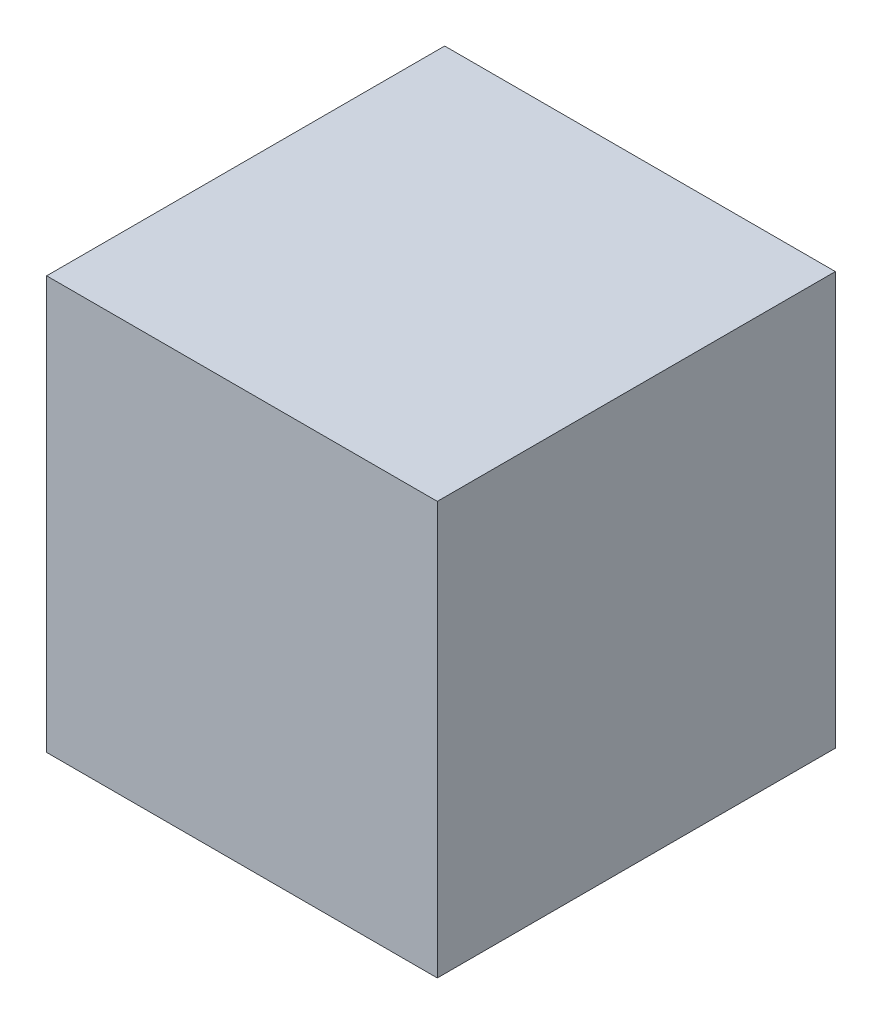
ISO-10303-21;
HEADER;
FILE_DESCRIPTION(('STEP AP214'),'2;1');
FILE_NAME('part.step','',(''),(''),'','','');
FILE_SCHEMA(('AUTOMOTIVE_DESIGN { 1 0 10303 214 1 1 1 1 }'));
ENDSEC;
DATA;
#1=APPLICATION_CONTEXT('core data for automotive mechanical design processes');
#2=APPLICATION_PROTOCOL_DEFINITION('international standard','automotive_design',2000,#1);
#3=PRODUCT_CONTEXT('',#1,'mechanical');
#4=PRODUCT('Part','Part','',(#3));
#5=PRODUCT_RELATED_PRODUCT_CATEGORY('part','',(#4));
#6=PRODUCT_DEFINITION_FORMATION('','',#4);
#7=PRODUCT_DEFINITION_CONTEXT('part definition',#1,'design');
#8=PRODUCT_DEFINITION('design','',#6,#7);
#9=PRODUCT_DEFINITION_SHAPE('','',#8);
#10=(LENGTH_UNIT() NAMED_UNIT(*) SI_UNIT(.MILLI.,.METRE.));
#11=(NAMED_UNIT(*) PLANE_ANGLE_UNIT() SI_UNIT($,.RADIAN.));
#12=(NAMED_UNIT(*) SI_UNIT($,.STERADIAN.) SOLID_ANGLE_UNIT());
#13=UNCERTAINTY_MEASURE_WITH_UNIT(LENGTH_MEASURE(1.E-05),#10,'distance_accuracy_value','');
#14=(GEOMETRIC_REPRESENTATION_CONTEXT(3) GLOBAL_UNCERTAINTY_ASSIGNED_CONTEXT((#13)) GLOBAL_UNIT_ASSIGNED_CONTEXT((#10,
#11,#12)) REPRESENTATION_CONTEXT('',''));
#15=CARTESIAN_POINT('',(0.,0.,0.));
#16=DIRECTION('',(0.,0.,1.));
#17=DIRECTION('',(1.,0.,0.));
#18=AXIS2_PLACEMENT_3D('',#15,#16,#17);
#19=CARTESIAN_POINT('',(0.,0.,171.45));
#20=DIRECTION('',(1.,0.,0.));
#21=DIRECTION('',(0.,0.,-1.));
#22=AXIS2_PLACEMENT_3D('',#19,#20,#21);
#23=PLANE('',#22);
#24=DIRECTION('',(0.,-1.,0.));
#25=VECTOR('',#24,1.);
#26=CARTESIAN_POINT('',(0.,0.,0.));
#27=LINE('',#26,#25);
#28=CARTESIAN_POINT('',(0.,177.8,0.));
#29=VERTEX_POINT('',#28);
#30=CARTESIAN_POINT('',(0.,0.,0.));
#31=VERTEX_POINT('',#30);
#32=EDGE_CURVE('E95',#29,#31,#27,.T.);
#33=ORIENTED_EDGE('',*,*,#32,.T.);
#34=DIRECTION('',(0.,0.,-1.));
#35=VECTOR('',#34,1.);
#36=CARTESIAN_POINT('',(0.,0.,171.45));
#37=LINE('',#36,#35);
#38=CARTESIAN_POINT('',(0.,0.,171.45));
#39=VERTEX_POINT('',#38);
#40=EDGE_CURVE('E11',#39,#31,#37,.T.);
#41=ORIENTED_EDGE('',*,*,#40,.F.);
#42=DIRECTION('',(0.,-1.,0.));
#43=VECTOR('',#42,1.);
#44=CARTESIAN_POINT('',(0.,0.,171.45));
#45=LINE('',#44,#43);
#46=CARTESIAN_POINT('',(0.,177.8,171.45));
#47=VERTEX_POINT('',#46);
#48=EDGE_CURVE('E83',#47,#39,#45,.T.);
#49=ORIENTED_EDGE('',*,*,#48,.F.);
#50=DIRECTION('',(0.,0.,-1.));
#51=VECTOR('',#50,1.);
#52=CARTESIAN_POINT('',(0.,177.8,171.45));
#53=LINE('',#52,#51);
#54=EDGE_CURVE('E91',#47,#29,#53,.T.);
#55=ORIENTED_EDGE('',*,*,#54,.T.);
#56=EDGE_LOOP('',(#33,#41,#49,#55));
#57=FACE_BOUND('',#56,.T.);
#58=ADVANCED_FACE('F32',(#57),#23,.F.);
#59=CARTESIAN_POINT('',(0.,0.,171.45));
#60=DIRECTION('',(0.,1.,0.));
#61=DIRECTION('',(0.,0.,1.));
#62=AXIS2_PLACEMENT_3D('',#59,#60,#61);
#63=PLANE('',#62);
#64=DIRECTION('',(1.,0.,0.));
#65=VECTOR('',#64,1.);
#66=CARTESIAN_POINT('',(0.,0.,0.));
#67=LINE('',#66,#65);
#68=CARTESIAN_POINT('',(168.275,0.,0.));
#69=VERTEX_POINT('',#68);
#70=EDGE_CURVE('E87',#31,#69,#67,.T.);
#71=ORIENTED_EDGE('',*,*,#70,.T.);
#72=DIRECTION('',(0.,0.,-1.));
#73=VECTOR('',#72,1.);
#74=CARTESIAN_POINT('',(168.275,0.,171.45));
#75=LINE('',#74,#73);
#76=CARTESIAN_POINT('',(168.275,0.,171.45));
#77=VERTEX_POINT('',#76);
#78=EDGE_CURVE('E40',#77,#69,#75,.T.);
#79=ORIENTED_EDGE('',*,*,#78,.F.);
#80=DIRECTION('',(1.,0.,0.));
#81=VECTOR('',#80,1.);
#82=CARTESIAN_POINT('',(0.,0.,171.45));
#83=LINE('',#82,#81);
#84=EDGE_CURVE('E78',#39,#77,#83,.T.);
#85=ORIENTED_EDGE('',*,*,#84,.F.);
#86=ORIENTED_EDGE('',*,*,#40,.T.);
#87=EDGE_LOOP('',(#71,#79,#85,#86));
#88=FACE_BOUND('',#87,.T.);
#89=ADVANCED_FACE('F86',(#88),#63,.F.);
#90=CARTESIAN_POINT('',(168.275,0.,171.45));
#91=DIRECTION('',(-1.,0.,0.));
#92=DIRECTION('',(0.,0.,1.));
#93=AXIS2_PLACEMENT_3D('',#90,#91,#92);
#94=PLANE('',#93);
#95=DIRECTION('',(0.,1.,0.));
#96=VECTOR('',#95,1.);
#97=CARTESIAN_POINT('',(168.275,0.,0.));
#98=LINE('',#97,#96);
#99=CARTESIAN_POINT('',(168.275,177.8,0.));
#100=VERTEX_POINT('',#99);
#101=EDGE_CURVE('E65',#69,#100,#98,.T.);
#102=ORIENTED_EDGE('',*,*,#101,.T.);
#103=DIRECTION('',(0.,0.,-1.));
#104=VECTOR('',#103,1.);
#105=CARTESIAN_POINT('',(168.275,177.8,171.45));
#106=LINE('',#105,#104);
#107=CARTESIAN_POINT('',(168.275,177.8,171.45));
#108=VERTEX_POINT('',#107);
#109=EDGE_CURVE('E88',#108,#100,#106,.T.);
#110=ORIENTED_EDGE('',*,*,#109,.F.);
#111=DIRECTION('',(0.,1.,0.));
#112=VECTOR('',#111,1.);
#113=CARTESIAN_POINT('',(168.275,0.,171.45));
#114=LINE('',#113,#112);
#115=EDGE_CURVE('E81',#77,#108,#114,.T.);
#116=ORIENTED_EDGE('',*,*,#115,.F.);
#117=ORIENTED_EDGE('',*,*,#78,.T.);
#118=EDGE_LOOP('',(#102,#110,#116,#117));
#119=FACE_BOUND('',#118,.T.);
#120=ADVANCED_FACE('F89',(#119),#94,.F.);
#121=CARTESIAN_POINT('',(0.,177.8,171.45));
#122=DIRECTION('',(0.,-1.,0.));
#123=DIRECTION('',(0.,0.,-1.));
#124=AXIS2_PLACEMENT_3D('',#121,#122,#123);
#125=PLANE('',#124);
#126=DIRECTION('',(-1.,0.,0.));
#127=VECTOR('',#126,1.);
#128=CARTESIAN_POINT('',(0.,177.8,0.));
#129=LINE('',#128,#127);
#130=EDGE_CURVE('E71',#100,#29,#129,.T.);
#131=ORIENTED_EDGE('',*,*,#130,.T.);
#132=ORIENTED_EDGE('',*,*,#54,.F.);
#133=DIRECTION('',(-1.,0.,0.));
#134=VECTOR('',#133,1.);
#135=CARTESIAN_POINT('',(0.,177.8,171.45));
#136=LINE('',#135,#134);
#137=EDGE_CURVE('E48',#108,#47,#136,.T.);
#138=ORIENTED_EDGE('',*,*,#137,.F.);
#139=ORIENTED_EDGE('',*,*,#109,.T.);
#140=EDGE_LOOP('',(#131,#132,#138,#139));
#141=FACE_BOUND('',#140,.T.);
#142=ADVANCED_FACE('F102',(#141),#125,.F.);
#143=CARTESIAN_POINT('',(0.,0.,171.45));
#144=DIRECTION('',(0.,0.,-1.));
#145=DIRECTION('',(-1.,0.,0.));
#146=AXIS2_PLACEMENT_3D('',#143,#144,#145);
#147=PLANE('',#146);
#148=ORIENTED_EDGE('',*,*,#48,.T.);
#149=ORIENTED_EDGE('',*,*,#84,.T.);
#150=ORIENTED_EDGE('',*,*,#115,.T.);
#151=ORIENTED_EDGE('',*,*,#137,.T.);
#152=EDGE_LOOP('',(#148,#149,#150,#151));
#153=FACE_BOUND('',#152,.T.);
#154=ADVANCED_FACE('F79',(#153),#147,.F.);
#155=CARTESIAN_POINT('',(0.,0.,0.));
#156=DIRECTION('',(0.,0.,-1.));
#157=DIRECTION('',(-1.,0.,0.));
#158=AXIS2_PLACEMENT_3D('',#155,#156,#157);
#159=PLANE('',#158);
#160=ORIENTED_EDGE('',*,*,#32,.F.);
#161=ORIENTED_EDGE('',*,*,#130,.F.);
#162=ORIENTED_EDGE('',*,*,#101,.F.);
#163=ORIENTED_EDGE('',*,*,#70,.F.);
#164=EDGE_LOOP('',(#160,#161,#162,#163));
#165=FACE_BOUND('',#164,.T.);
#166=ADVANCED_FACE('F105',(#165),#159,.T.);
#167=CLOSED_SHELL('',(#58,#89,#120,#142,#154,#166));
#168=MANIFOLD_SOLID_BREP('B2',#167);
#169=ADVANCED_BREP_SHAPE_REPRESENTATION('',(#18,#168),#14);
#170=SHAPE_DEFINITION_REPRESENTATION(#9,#169);
ENDSEC;
END-ISO-10303-21;
